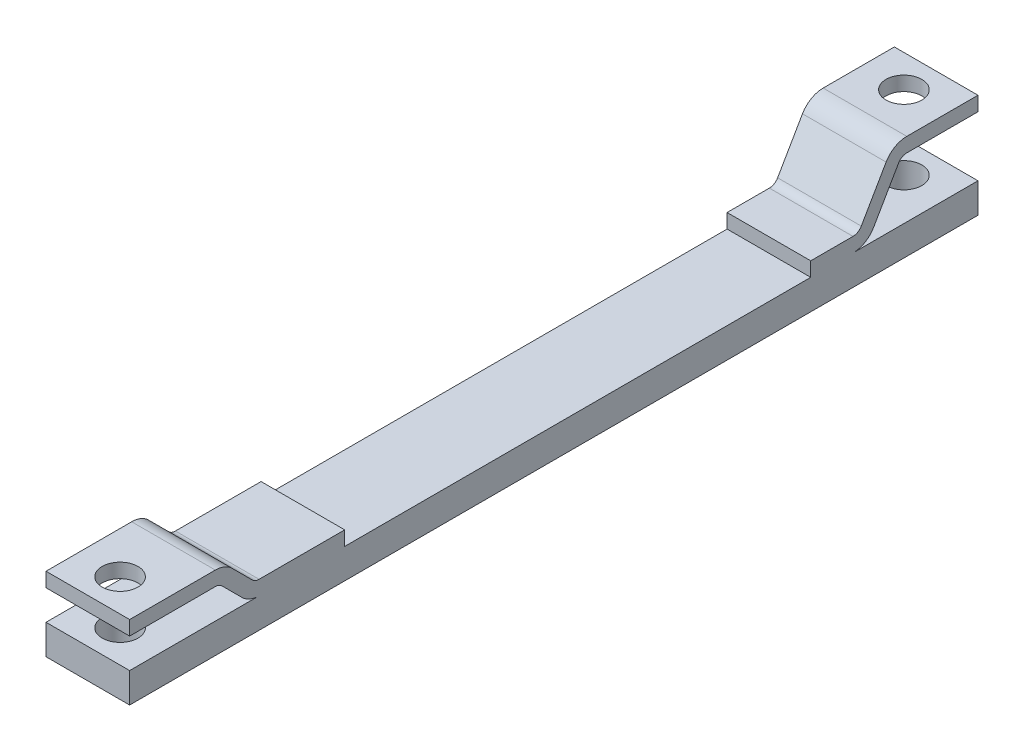
ISO-10303-21;
HEADER;
FILE_DESCRIPTION(('STEP AP214'),'2;1');
FILE_NAME('part.step','',(''),(''),'','','');
FILE_SCHEMA(('AUTOMOTIVE_DESIGN { 1 0 10303 214 1 1 1 1 }'));
ENDSEC;
DATA;
#1=APPLICATION_CONTEXT('core data for automotive mechanical design processes');
#2=APPLICATION_PROTOCOL_DEFINITION('international standard','automotive_design',2000,#1);
#3=PRODUCT_CONTEXT('',#1,'mechanical');
#4=PRODUCT('Part','Part','',(#3));
#5=PRODUCT_RELATED_PRODUCT_CATEGORY('part','',(#4));
#6=PRODUCT_DEFINITION_FORMATION('','',#4);
#7=PRODUCT_DEFINITION_CONTEXT('part definition',#1,'design');
#8=PRODUCT_DEFINITION('design','',#6,#7);
#9=PRODUCT_DEFINITION_SHAPE('','',#8);
#10=(LENGTH_UNIT() NAMED_UNIT(*) SI_UNIT(.MILLI.,.METRE.));
#11=(NAMED_UNIT(*) PLANE_ANGLE_UNIT() SI_UNIT($,.RADIAN.));
#12=(NAMED_UNIT(*) SI_UNIT($,.STERADIAN.) SOLID_ANGLE_UNIT());
#13=UNCERTAINTY_MEASURE_WITH_UNIT(LENGTH_MEASURE(1.E-05),#10,'distance_accuracy_value','');
#14=(GEOMETRIC_REPRESENTATION_CONTEXT(3) GLOBAL_UNCERTAINTY_ASSIGNED_CONTEXT((#13)) GLOBAL_UNIT_ASSIGNED_CONTEXT((#10,
#11,#12)) REPRESENTATION_CONTEXT('',''));
#15=CARTESIAN_POINT('',(0.,0.,0.));
#16=DIRECTION('',(0.,0.,1.));
#17=DIRECTION('',(1.,0.,0.));
#18=AXIS2_PLACEMENT_3D('',#15,#16,#17);
#19=CARTESIAN_POINT('',(70.,0.,-911.522356507685));
#20=DIRECTION('',(0.,1.,0.));
#21=DIRECTION('',(0.,0.,1.));
#22=AXIS2_PLACEMENT_3D('',#19,#20,#21);
#23=PLANE('',#22);
#24=CARTESIAN_POINT('',(35.,0.,-683.));
#25=DIRECTION('',(0.,1.,0.));
#26=DIRECTION('',(0.,0.,1.));
#27=AXIS2_PLACEMENT_3D('',#24,#25,#26);
#28=CIRCLE('',#27,15.);
#29=CARTESIAN_POINT('',(35.,0.,-668.));
#30=VERTEX_POINT('',#29);
#31=EDGE_CURVE('E474',#30,#30,#28,.T.);
#32=ORIENTED_EDGE('',*,*,#31,.T.);
#33=EDGE_LOOP('',(#32));
#34=FACE_BOUND('',#33,.T.);
#35=DIRECTION('',(0.,0.,-1.));
#36=VECTOR('',#35,1.);
#37=CARTESIAN_POINT('',(0.,0.,-911.522356507685));
#38=LINE('',#37,#36);
#39=CARTESIAN_POINT('',(0.,0.,0.));
#40=VERTEX_POINT('',#39);
#41=CARTESIAN_POINT('',(0.,0.,-710.));
#42=VERTEX_POINT('',#41);
#43=EDGE_CURVE('E260',#40,#42,#38,.T.);
#44=ORIENTED_EDGE('',*,*,#43,.T.);
#45=DIRECTION('',(-1.,0.,0.));
#46=VECTOR('',#45,1.);
#47=CARTESIAN_POINT('',(70.,0.,-710.));
#48=LINE('',#47,#46);
#49=CARTESIAN_POINT('',(70.,0.,-710.));
#50=VERTEX_POINT('',#49);
#51=EDGE_CURVE('E372',#50,#42,#48,.T.);
#52=ORIENTED_EDGE('',*,*,#51,.F.);
#53=DIRECTION('',(0.,0.,-1.));
#54=VECTOR('',#53,1.);
#55=CARTESIAN_POINT('',(70.,0.,-911.522356507685));
#56=LINE('',#55,#54);
#57=CARTESIAN_POINT('',(70.,0.,0.));
#58=VERTEX_POINT('',#57);
#59=EDGE_CURVE('E404',#58,#50,#56,.T.);
#60=ORIENTED_EDGE('',*,*,#59,.F.);
#61=DIRECTION('',(-1.,0.,0.));
#62=VECTOR('',#61,1.);
#63=CARTESIAN_POINT('',(70.,0.,0.));
#64=LINE('',#63,#62);
#65=EDGE_CURVE('E375',#58,#40,#64,.T.);
#66=ORIENTED_EDGE('',*,*,#65,.T.);
#67=EDGE_LOOP('',(#44,#52,#60,#66));
#68=FACE_BOUND('',#67,.T.);
#69=CARTESIAN_POINT('',(35.,0.,-27.0000000000002));
#70=DIRECTION('',(0.,1.,0.));
#71=DIRECTION('',(0.,0.,1.));
#72=AXIS2_PLACEMENT_3D('',#69,#70,#71);
#73=CIRCLE('',#72,15.);
#74=CARTESIAN_POINT('',(35.,0.,-12.0000000000002));
#75=VERTEX_POINT('',#74);
#76=EDGE_CURVE('E844',#75,#75,#73,.T.);
#77=ORIENTED_EDGE('',*,*,#76,.T.);
#78=EDGE_LOOP('',(#77));
#79=FACE_BOUND('',#78,.T.);
#80=ADVANCED_FACE('F36',(#34,#68,#79),#23,.F.);
#81=CARTESIAN_POINT('',(70.,25.0000000000005,-911.522356507685));
#82=DIRECTION('',(0.,-1.,0.));
#83=DIRECTION('',(0.,0.,-1.));
#84=AXIS2_PLACEMENT_3D('',#81,#82,#83);
#85=PLANE('',#84);
#86=DIRECTION('',(0.,0.,1.));
#87=VECTOR('',#86,1.);
#88=CARTESIAN_POINT('',(0.,25.0000000000005,-911.522356507685));
#89=LINE('',#88,#87);
#90=CARTESIAN_POINT('',(0.,25.0000000000001,-108.284271247462));
#91=VERTEX_POINT('',#90);
#92=CARTESIAN_POINT('',(0.,25.,0.));
#93=VERTEX_POINT('',#92);
#94=EDGE_CURVE('E255',#91,#93,#89,.T.);
#95=ORIENTED_EDGE('',*,*,#94,.T.);
#96=DIRECTION('',(-1.,0.,0.));
#97=VECTOR('',#96,1.);
#98=CARTESIAN_POINT('',(70.,25.,0.));
#99=LINE('',#98,#97);
#100=CARTESIAN_POINT('',(70.,25.,0.));
#101=VERTEX_POINT('',#100);
#102=EDGE_CURVE('E46',#101,#93,#99,.T.);
#103=ORIENTED_EDGE('',*,*,#102,.F.);
#104=DIRECTION('',(0.,0.,1.));
#105=VECTOR('',#104,1.);
#106=CARTESIAN_POINT('',(70.,25.0000000000005,-911.522356507685));
#107=LINE('',#106,#105);
#108=CARTESIAN_POINT('',(70.,25.0000000000001,-108.284271247462));
#109=VERTEX_POINT('',#108);
#110=EDGE_CURVE('E462',#109,#101,#107,.T.);
#111=ORIENTED_EDGE('',*,*,#110,.F.);
#112=DIRECTION('',(-1.,0.,0.));
#113=VECTOR('',#112,1.);
#114=CARTESIAN_POINT('',(70.,25.0000000000001,-108.284271247462));
#115=LINE('',#114,#113);
#116=EDGE_CURVE('E11',#109,#91,#115,.T.);
#117=ORIENTED_EDGE('',*,*,#116,.T.);
#118=EDGE_LOOP('',(#95,#103,#111,#117));
#119=FACE_BOUND('',#118,.T.);
#120=CARTESIAN_POINT('',(35.,25.,-27.0000000000002));
#121=DIRECTION('',(0.,-1.,0.));
#122=DIRECTION('',(0.,0.,-1.));
#123=AXIS2_PLACEMENT_3D('',#120,#121,#122);
#124=CIRCLE('',#123,15.);
#125=CARTESIAN_POINT('',(35.,25.,-42.0000000000002));
#126=VERTEX_POINT('',#125);
#127=EDGE_CURVE('E472',#126,#126,#124,.F.);
#128=ORIENTED_EDGE('',*,*,#127,.F.);
#129=EDGE_LOOP('',(#128));
#130=FACE_BOUND('',#129,.T.);
#131=ADVANCED_FACE('F467',(#119,#130),#85,.F.);
#132=CARTESIAN_POINT('',(70.,61.9999999999993,-911.522356507685));
#133=DIRECTION('',(0.,-1.,0.));
#134=DIRECTION('',(0.,0.,-1.));
#135=AXIS2_PLACEMENT_3D('',#132,#133,#134);
#136=PLANE('',#135);
#137=DIRECTION('',(0.,0.,1.));
#138=VECTOR('',#137,1.);
#139=CARTESIAN_POINT('',(0.,61.9999999999993,-911.522356507685));
#140=LINE('',#139,#138);
#141=CARTESIAN_POINT('',(0.,62.,-71.7157287525382));
#142=VERTEX_POINT('',#141);
#143=CARTESIAN_POINT('',(0.,62.0000000000001,0.));
#144=VERTEX_POINT('',#143);
#145=EDGE_CURVE('E308',#142,#144,#140,.T.);
#146=ORIENTED_EDGE('',*,*,#145,.T.);
#147=DIRECTION('',(-1.,0.,0.));
#148=VECTOR('',#147,1.);
#149=CARTESIAN_POINT('',(70.,62.0000000000001,0.));
#150=LINE('',#149,#148);
#151=CARTESIAN_POINT('',(70.,62.0000000000001,0.));
#152=VERTEX_POINT('',#151);
#153=EDGE_CURVE('E320',#152,#144,#150,.T.);
#154=ORIENTED_EDGE('',*,*,#153,.F.);
#155=DIRECTION('',(0.,0.,1.));
#156=VECTOR('',#155,1.);
#157=CARTESIAN_POINT('',(70.,61.9999999999993,-911.522356507685));
#158=LINE('',#157,#156);
#159=CARTESIAN_POINT('',(70.,62.,-71.7157287525382));
#160=VERTEX_POINT('',#159);
#161=EDGE_CURVE('E448',#160,#152,#158,.T.);
#162=ORIENTED_EDGE('',*,*,#161,.F.);
#163=DIRECTION('',(-1.,0.,0.));
#164=VECTOR('',#163,1.);
#165=CARTESIAN_POINT('',(70.,62.,-71.7157287525382));
#166=LINE('',#165,#164);
#167=EDGE_CURVE('E323',#160,#142,#166,.T.);
#168=ORIENTED_EDGE('',*,*,#167,.T.);
#169=EDGE_LOOP('',(#146,#154,#162,#168));
#170=FACE_BOUND('',#169,.T.);
#171=CARTESIAN_POINT('',(35.,62.,-27.0000000000002));
#172=DIRECTION('',(0.,-1.,0.));
#173=DIRECTION('',(0.,0.,-1.));
#174=AXIS2_PLACEMENT_3D('',#171,#172,#173);
#175=CIRCLE('',#174,15.);
#176=CARTESIAN_POINT('',(35.,62.,-42.0000000000002));
#177=VERTEX_POINT('',#176);
#178=EDGE_CURVE('E475',#177,#177,#175,.F.);
#179=ORIENTED_EDGE('',*,*,#178,.F.);
#180=EDGE_LOOP('',(#179));
#181=FACE_BOUND('',#180,.T.);
#182=ADVANCED_FACE('F453',(#170,#181),#136,.F.);
#183=CARTESIAN_POINT('',(70.,49.9999999999999,-911.522356507685));
#184=DIRECTION('',(0.,1.,0.));
#185=DIRECTION('',(0.,0.,1.));
#186=AXIS2_PLACEMENT_3D('',#183,#184,#185);
#187=PLANE('',#186);
#188=DIRECTION('',(0.,0.,-1.));
#189=VECTOR('',#188,1.);
#190=CARTESIAN_POINT('',(0.,49.9999999999999,-911.522356507685));
#191=LINE('',#190,#189);
#192=CARTESIAN_POINT('',(0.,49.9999999999999,0.));
#193=VERTEX_POINT('',#192);
#194=CARTESIAN_POINT('',(0.,49.9999999999999,-71.6862915010153));
#195=VERTEX_POINT('',#194);
#196=EDGE_CURVE('E243',#193,#195,#191,.T.);
#197=ORIENTED_EDGE('',*,*,#196,.T.);
#198=DIRECTION('',(-1.,0.,0.));
#199=VECTOR('',#198,1.);
#200=CARTESIAN_POINT('',(70.,49.9999999999999,-71.6862915010153));
#201=LINE('',#200,#199);
#202=CARTESIAN_POINT('',(70.,49.9999999999999,-71.6862915010153));
#203=VERTEX_POINT('',#202);
#204=EDGE_CURVE('E239',#203,#195,#201,.T.);
#205=ORIENTED_EDGE('',*,*,#204,.F.);
#206=DIRECTION('',(0.,0.,-1.));
#207=VECTOR('',#206,1.);
#208=CARTESIAN_POINT('',(70.,49.9999999999999,-911.522356507685));
#209=LINE('',#208,#207);
#210=CARTESIAN_POINT('',(70.,49.9999999999999,0.));
#211=VERTEX_POINT('',#210);
#212=EDGE_CURVE('E228',#211,#203,#209,.T.);
#213=ORIENTED_EDGE('',*,*,#212,.F.);
#214=DIRECTION('',(-1.,0.,0.));
#215=VECTOR('',#214,1.);
#216=CARTESIAN_POINT('',(70.,49.9999999999999,0.));
#217=LINE('',#216,#215);
#218=EDGE_CURVE('E244',#211,#193,#217,.T.);
#219=ORIENTED_EDGE('',*,*,#218,.T.);
#220=EDGE_LOOP('',(#197,#205,#213,#219));
#221=FACE_BOUND('',#220,.T.);
#222=CARTESIAN_POINT('',(35.,49.9999999999999,-27.0000000000002));
#223=DIRECTION('',(0.,1.,0.));
#224=DIRECTION('',(0.,0.,1.));
#225=AXIS2_PLACEMENT_3D('',#222,#223,#224);
#226=CIRCLE('',#225,15.);
#227=CARTESIAN_POINT('',(35.,49.9999999999999,-12.0000000000002));
#228=VERTEX_POINT('',#227);
#229=EDGE_CURVE('E40',#228,#228,#226,.F.);
#230=ORIENTED_EDGE('',*,*,#229,.F.);
#231=EDGE_LOOP('',(#230));
#232=FACE_BOUND('',#231,.T.);
#233=ADVANCED_FACE('F240',(#221,#232),#187,.F.);
#234=CARTESIAN_POINT('',(70.,25.0000000000005,-911.522356507685));
#235=DIRECTION('',(0.,-1.,0.));
#236=DIRECTION('',(0.,0.,-1.));
#237=AXIS2_PLACEMENT_3D('',#234,#235,#236);
#238=PLANE('',#237);
#239=DIRECTION('',(0.,0.,1.));
#240=VECTOR('',#239,1.);
#241=CARTESIAN_POINT('',(0.,25.0000000000005,-911.522356507685));
#242=LINE('',#241,#240);
#243=CARTESIAN_POINT('',(0.,25.0000000000002,-710.));
#244=VERTEX_POINT('',#243);
#245=CARTESIAN_POINT('',(0.,25.,-605.381197846483));
#246=VERTEX_POINT('',#245);
#247=EDGE_CURVE('E264',#244,#246,#242,.T.);
#248=ORIENTED_EDGE('',*,*,#247,.T.);
#249=DIRECTION('',(-1.,0.,0.));
#250=VECTOR('',#249,1.);
#251=CARTESIAN_POINT('',(70.,25.,-605.381197846483));
#252=LINE('',#251,#250);
#253=CARTESIAN_POINT('',(70.,25.,-605.381197846483));
#254=VERTEX_POINT('',#253);
#255=EDGE_CURVE('E367',#254,#246,#252,.T.);
#256=ORIENTED_EDGE('',*,*,#255,.F.);
#257=DIRECTION('',(0.,0.,1.));
#258=VECTOR('',#257,1.);
#259=CARTESIAN_POINT('',(70.,25.0000000000005,-911.522356507685));
#260=LINE('',#259,#258);
#261=CARTESIAN_POINT('',(70.,25.0000000000002,-710.));
#262=VERTEX_POINT('',#261);
#263=EDGE_CURVE('E403',#262,#254,#260,.T.);
#264=ORIENTED_EDGE('',*,*,#263,.F.);
#265=DIRECTION('',(-1.,0.,0.));
#266=VECTOR('',#265,1.);
#267=CARTESIAN_POINT('',(70.,25.0000000000002,-710.));
#268=LINE('',#267,#266);
#269=EDGE_CURVE('E369',#262,#244,#268,.T.);
#270=ORIENTED_EDGE('',*,*,#269,.T.);
#271=EDGE_LOOP('',(#248,#256,#264,#270));
#272=FACE_BOUND('',#271,.T.);
#273=CARTESIAN_POINT('',(35.,25.0000000000001,-683.));
#274=DIRECTION('',(0.,-1.,0.));
#275=DIRECTION('',(0.,0.,-1.));
#276=AXIS2_PLACEMENT_3D('',#273,#274,#275);
#277=CIRCLE('',#276,15.);
#278=CARTESIAN_POINT('',(35.,25.0000000000002,-698.));
#279=VERTEX_POINT('',#278);
#280=EDGE_CURVE('E256',#279,#279,#277,.F.);
#281=ORIENTED_EDGE('',*,*,#280,.F.);
#282=EDGE_LOOP('',(#281));
#283=FACE_BOUND('',#282,.T.);
#284=ADVANCED_FACE('F494',(#272,#283),#238,.F.);
#285=CARTESIAN_POINT('',(70.,75.0000000000007,-911.522356507685));
#286=DIRECTION('',(0.,1.,0.));
#287=DIRECTION('',(0.,0.,1.));
#288=AXIS2_PLACEMENT_3D('',#285,#286,#287);
#289=PLANE('',#288);
#290=DIRECTION('',(0.,0.,-1.));
#291=VECTOR('',#290,1.);
#292=CARTESIAN_POINT('',(0.,75.0000000000007,-911.522356507685));
#293=LINE('',#292,#291);
#294=CARTESIAN_POINT('',(0.,75.,-650.414518843274));
#295=VERTEX_POINT('',#294);
#296=CARTESIAN_POINT('',(0.,75.0000000000002,-710.));
#297=VERTEX_POINT('',#296);
#298=EDGE_CURVE('E276',#295,#297,#293,.T.);
#299=ORIENTED_EDGE('',*,*,#298,.T.);
#300=DIRECTION('',(-1.,0.,0.));
#301=VECTOR('',#300,1.);
#302=CARTESIAN_POINT('',(70.,75.0000000000002,-710.));
#303=LINE('',#302,#301);
#304=CARTESIAN_POINT('',(70.,75.0000000000002,-710.));
#305=VERTEX_POINT('',#304);
#306=EDGE_CURVE('E358',#305,#297,#303,.T.);
#307=ORIENTED_EDGE('',*,*,#306,.F.);
#308=DIRECTION('',(0.,0.,-1.));
#309=VECTOR('',#308,1.);
#310=CARTESIAN_POINT('',(70.,75.0000000000007,-911.522356507685));
#311=LINE('',#310,#309);
#312=CARTESIAN_POINT('',(70.,75.,-650.414518843274));
#313=VERTEX_POINT('',#312);
#314=EDGE_CURVE('E418',#313,#305,#311,.T.);
#315=ORIENTED_EDGE('',*,*,#314,.F.);
#316=DIRECTION('',(-1.,0.,0.));
#317=VECTOR('',#316,1.);
#318=CARTESIAN_POINT('',(70.,75.,-650.414518843274));
#319=LINE('',#318,#317);
#320=EDGE_CURVE('E361',#313,#295,#319,.T.);
#321=ORIENTED_EDGE('',*,*,#320,.T.);
#322=EDGE_LOOP('',(#299,#307,#315,#321));
#323=FACE_BOUND('',#322,.T.);
#324=CARTESIAN_POINT('',(35.,75.0000000000001,-683.));
#325=DIRECTION('',(0.,1.,0.));
#326=DIRECTION('',(0.,0.,1.));
#327=AXIS2_PLACEMENT_3D('',#324,#325,#326);
#328=CIRCLE('',#327,15.);
#329=CARTESIAN_POINT('',(35.,75.0000000000001,-668.));
#330=VERTEX_POINT('',#329);
#331=EDGE_CURVE('E485',#330,#330,#328,.F.);
#332=ORIENTED_EDGE('',*,*,#331,.F.);
#333=EDGE_LOOP('',(#332));
#334=FACE_BOUND('',#333,.T.);
#335=ADVANCED_FACE('F496',(#323,#334),#289,.F.);
#336=CARTESIAN_POINT('',(70.,87.0000000000007,-911.522356507685));
#337=DIRECTION('',(0.,-1.,0.));
#338=DIRECTION('',(0.,0.,-1.));
#339=AXIS2_PLACEMENT_3D('',#336,#337,#338);
#340=PLANE('',#339);
#341=DIRECTION('',(0.,0.,1.));
#342=VECTOR('',#341,1.);
#343=CARTESIAN_POINT('',(0.,87.0000000000007,-911.522356507685));
#344=LINE('',#343,#342);
#345=CARTESIAN_POINT('',(0.,87.0000000000001,-710.));
#346=VERTEX_POINT('',#345);
#347=CARTESIAN_POINT('',(0.,87.,-650.414518843274));
#348=VERTEX_POINT('',#347);
#349=EDGE_CURVE('E280',#346,#348,#344,.T.);
#350=ORIENTED_EDGE('',*,*,#349,.T.);
#351=DIRECTION('',(-1.,0.,0.));
#352=VECTOR('',#351,1.);
#353=CARTESIAN_POINT('',(70.,87.,-650.414518843274));
#354=LINE('',#353,#352);
#355=CARTESIAN_POINT('',(70.,87.,-650.414518843274));
#356=VERTEX_POINT('',#355);
#357=EDGE_CURVE('E352',#356,#348,#354,.T.);
#358=ORIENTED_EDGE('',*,*,#357,.F.);
#359=DIRECTION('',(0.,0.,1.));
#360=VECTOR('',#359,1.);
#361=CARTESIAN_POINT('',(70.,87.0000000000007,-911.522356507685));
#362=LINE('',#361,#360);
#363=CARTESIAN_POINT('',(70.,87.0000000000001,-710.));
#364=VERTEX_POINT('',#363);
#365=EDGE_CURVE('E422',#364,#356,#362,.T.);
#366=ORIENTED_EDGE('',*,*,#365,.F.);
#367=DIRECTION('',(-1.,0.,0.));
#368=VECTOR('',#367,1.);
#369=CARTESIAN_POINT('',(70.,87.0000000000001,-710.));
#370=LINE('',#369,#368);
#371=EDGE_CURVE('E355',#364,#346,#370,.T.);
#372=ORIENTED_EDGE('',*,*,#371,.T.);
#373=EDGE_LOOP('',(#350,#358,#366,#372));
#374=FACE_BOUND('',#373,.T.);
#375=CARTESIAN_POINT('',(35.,87.0000000000001,-683.));
#376=DIRECTION('',(0.,1.,0.));
#377=DIRECTION('',(0.,0.,1.));
#378=AXIS2_PLACEMENT_3D('',#375,#376,#377);
#379=CIRCLE('',#378,15.);
#380=CARTESIAN_POINT('',(35.,87.0000000000001,-668.));
#381=VERTEX_POINT('',#380);
#382=EDGE_CURVE('E478',#381,#381,#379,.T.);
#383=ORIENTED_EDGE('',*,*,#382,.F.);
#384=EDGE_LOOP('',(#383));
#385=FACE_BOUND('',#384,.T.);
#386=ADVANCED_FACE('F503',(#374,#385),#340,.F.);
#387=CARTESIAN_POINT('',(70.,45.0000000000001,-108.284271247462));
#388=DIRECTION('',(-1.,0.,0.));
#389=DIRECTION('',(0.,0.,1.));
#390=AXIS2_PLACEMENT_3D('',#387,#388,#389);
#391=CYLINDRICAL_SURFACE('',#390,20.);
#392=CARTESIAN_POINT('',(0.,45.0000000000001,-108.284271247462));
#393=DIRECTION('',(1.,0.,0.));
#394=DIRECTION('',(0.,0.,-1.));
#395=AXIS2_PLACEMENT_3D('',#392,#393,#394);
#396=CIRCLE('',#395,20.);
#397=CARTESIAN_POINT('',(0.,30.8578643762691,-94.1421356237309));
#398=VERTEX_POINT('',#397);
#399=EDGE_CURVE('E252',#91,#398,#396,.F.);
#400=ORIENTED_EDGE('',*,*,#399,.F.);
#401=ORIENTED_EDGE('',*,*,#116,.F.);
#402=CARTESIAN_POINT('',(70.,45.0000000000001,-108.284271247462));
#403=DIRECTION('',(1.,0.,0.));
#404=DIRECTION('',(0.,0.,-1.));
#405=AXIS2_PLACEMENT_3D('',#402,#403,#404);
#406=CIRCLE('',#405,20.);
#407=CARTESIAN_POINT('',(70.,30.8578643762691,-94.1421356237309));
#408=VERTEX_POINT('',#407);
#409=EDGE_CURVE('E316',#109,#408,#406,.F.);
#410=ORIENTED_EDGE('',*,*,#409,.T.);
#411=DIRECTION('',(-1.,0.,0.));
#412=VECTOR('',#411,1.);
#413=CARTESIAN_POINT('',(70.,30.8578643762691,-94.1421356237309));
#414=LINE('',#413,#412);
#415=EDGE_CURVE('E149',#408,#398,#414,.T.);
#416=ORIENTED_EDGE('',*,*,#415,.T.);
#417=EDGE_LOOP('',(#400,#401,#410,#416));
#418=FACE_BOUND('',#417,.T.);
#419=ADVANCED_FACE('F38',(#418),#391,.T.);
#420=CARTESIAN_POINT('',(70.,43.5000000000005,0.));
#421=DIRECTION('',(0.,0.,-1.));
#422=DIRECTION('',(0.,1.,0.));
#423=AXIS2_PLACEMENT_3D('',#420,#421,#422);
#424=PLANE('',#423);
#425=DIRECTION('',(0.,-1.,0.));
#426=VECTOR('',#425,1.);
#427=CARTESIAN_POINT('',(0.,43.5000000000005,0.));
#428=LINE('',#427,#426);
#429=EDGE_CURVE('E258',#93,#40,#428,.T.);
#430=ORIENTED_EDGE('',*,*,#429,.T.);
#431=ORIENTED_EDGE('',*,*,#65,.F.);
#432=DIRECTION('',(0.,-1.,0.));
#433=VECTOR('',#432,1.);
#434=CARTESIAN_POINT('',(70.,43.5000000000005,0.));
#435=LINE('',#434,#433);
#436=EDGE_CURVE('E385',#101,#58,#435,.T.);
#437=ORIENTED_EDGE('',*,*,#436,.F.);
#438=ORIENTED_EDGE('',*,*,#102,.T.);
#439=EDGE_LOOP('',(#430,#431,#437,#438));
#440=FACE_BOUND('',#439,.T.);
#441=ADVANCED_FACE('F383',(#440),#424,.F.);
#442=CARTESIAN_POINT('',(70.,43.5,-710.));
#443=DIRECTION('',(0.,0.,1.));
#444=DIRECTION('',(1.,0.,0.));
#445=AXIS2_PLACEMENT_3D('',#442,#443,#444);
#446=PLANE('',#445);
#447=DIRECTION('',(0.,1.,0.));
#448=VECTOR('',#447,1.);
#449=CARTESIAN_POINT('',(0.,43.5,-710.));
#450=LINE('',#449,#448);
#451=EDGE_CURVE('E262',#42,#244,#450,.T.);
#452=ORIENTED_EDGE('',*,*,#451,.T.);
#453=ORIENTED_EDGE('',*,*,#269,.F.);
#454=DIRECTION('',(0.,1.,0.));
#455=VECTOR('',#454,1.);
#456=CARTESIAN_POINT('',(70.,43.5,-710.));
#457=LINE('',#456,#455);
#458=EDGE_CURVE('E401',#50,#262,#457,.T.);
#459=ORIENTED_EDGE('',*,*,#458,.F.);
#460=ORIENTED_EDGE('',*,*,#51,.T.);
#461=EDGE_LOOP('',(#452,#453,#459,#460));
#462=FACE_BOUND('',#461,.T.);
#463=ADVANCED_FACE('F399',(#462),#446,.F.);
#464=CARTESIAN_POINT('',(70.,45.0000000000001,-605.381197846483));
#465=DIRECTION('',(-1.,0.,0.));
#466=DIRECTION('',(0.,0.,1.));
#467=AXIS2_PLACEMENT_3D('',#464,#465,#466);
#468=CYLINDRICAL_SURFACE('',#467,20.0000000000002);
#469=CARTESIAN_POINT('',(0.,45.0000000000001,-605.381197846483));
#470=DIRECTION('',(1.,0.,0.));
#471=DIRECTION('',(0.,0.,-1.));
#472=AXIS2_PLACEMENT_3D('',#469,#470,#471);
#473=CIRCLE('',#472,20.0000000000002);
#474=CARTESIAN_POINT('',(0.,34.9999999999999,-622.701705922172));
#475=VERTEX_POINT('',#474);
#476=EDGE_CURVE('E267',#475,#246,#473,.F.);
#477=ORIENTED_EDGE('',*,*,#476,.F.);
#478=DIRECTION('',(-1.,0.,0.));
#479=VECTOR('',#478,1.);
#480=CARTESIAN_POINT('',(70.,34.9999999999999,-622.701705922172));
#481=LINE('',#480,#479);
#482=CARTESIAN_POINT('',(70.,34.9999999999999,-622.701705922172));
#483=VERTEX_POINT('',#482);
#484=EDGE_CURVE('E365',#483,#475,#481,.T.);
#485=ORIENTED_EDGE('',*,*,#484,.F.);
#486=CARTESIAN_POINT('',(70.,45.0000000000001,-605.381197846483));
#487=DIRECTION('',(1.,0.,0.));
#488=DIRECTION('',(0.,0.,-1.));
#489=AXIS2_PLACEMENT_3D('',#486,#487,#488);
#490=CIRCLE('',#489,20.0000000000002);
#491=EDGE_CURVE('E406',#483,#254,#490,.F.);
#492=ORIENTED_EDGE('',*,*,#491,.T.);
#493=ORIENTED_EDGE('',*,*,#255,.T.);
#494=EDGE_LOOP('',(#477,#485,#492,#493));
#495=FACE_BOUND('',#494,.T.);
#496=ADVANCED_FACE('F520',(#495),#468,.T.);
#497=CARTESIAN_POINT('',(70.,166.438010272303,-698.587476534635));
#498=DIRECTION('',(0.,0.500000000000004,0.866025403784436));
#499=DIRECTION('',(0.,-0.866025403784436,0.500000000000004));
#500=AXIS2_PLACEMENT_3D('',#497,#498,#499);
#501=PLANE('',#500);
#502=DIRECTION('',(0.,0.866025403784436,-0.500000000000004));
#503=VECTOR('',#502,1.);
#504=CARTESIAN_POINT('',(0.,166.438010272303,-698.587476534635));
#505=LINE('',#504,#503);
#506=CARTESIAN_POINT('',(0.,71.0000000000001,-643.486315612998));
#507=VERTEX_POINT('',#506);
#508=EDGE_CURVE('E270',#475,#507,#505,.T.);
#509=ORIENTED_EDGE('',*,*,#508,.T.);
#510=DIRECTION('',(-1.,0.,0.));
#511=VECTOR('',#510,1.);
#512=CARTESIAN_POINT('',(70.,71.0000000000001,-643.486315612998));
#513=LINE('',#512,#511);
#514=CARTESIAN_POINT('',(70.,71.0000000000001,-643.486315612998));
#515=VERTEX_POINT('',#514);
#516=EDGE_CURVE('E363',#515,#507,#513,.T.);
#517=ORIENTED_EDGE('',*,*,#516,.F.);
#518=DIRECTION('',(0.,0.866025403784436,-0.500000000000004));
#519=VECTOR('',#518,1.);
#520=CARTESIAN_POINT('',(70.,166.438010272303,-698.587476534635));
#521=LINE('',#520,#519);
#522=EDGE_CURVE('E413',#483,#515,#521,.T.);
#523=ORIENTED_EDGE('',*,*,#522,.F.);
#524=ORIENTED_EDGE('',*,*,#484,.T.);
#525=EDGE_LOOP('',(#509,#517,#523,#524));
#526=FACE_BOUND('',#525,.T.);
#527=ADVANCED_FACE('F540',(#526),#501,.F.);
#528=CARTESIAN_POINT('',(70.,67.0000000000002,-650.414518843274));
#529=DIRECTION('',(-1.,0.,0.));
#530=DIRECTION('',(0.,0.,1.));
#531=AXIS2_PLACEMENT_3D('',#528,#529,#530);
#532=CYLINDRICAL_SURFACE('',#531,7.99999999999986);
#533=CARTESIAN_POINT('',(0.,67.0000000000002,-650.414518843274));
#534=DIRECTION('',(1.,0.,0.));
#535=DIRECTION('',(0.,0.,-1.));
#536=AXIS2_PLACEMENT_3D('',#533,#534,#535);
#537=CIRCLE('',#536,7.99999999999986);
#538=EDGE_CURVE('E273',#295,#507,#537,.T.);
#539=ORIENTED_EDGE('',*,*,#538,.F.);
#540=ORIENTED_EDGE('',*,*,#320,.F.);
#541=CARTESIAN_POINT('',(70.,67.0000000000002,-650.414518843274));
#542=DIRECTION('',(1.,0.,0.));
#543=DIRECTION('',(0.,0.,-1.));
#544=AXIS2_PLACEMENT_3D('',#541,#542,#543);
#545=CIRCLE('',#544,7.99999999999986);
#546=EDGE_CURVE('E415',#313,#515,#545,.T.);
#547=ORIENTED_EDGE('',*,*,#546,.T.);
#548=ORIENTED_EDGE('',*,*,#516,.T.);
#549=EDGE_LOOP('',(#539,#540,#547,#548));
#550=FACE_BOUND('',#549,.T.);
#551=ADVANCED_FACE('F535',(#550),#532,.F.);
#552=CARTESIAN_POINT('',(70.,43.5,-710.));
#553=DIRECTION('',(0.,0.,1.));
#554=DIRECTION('',(1.,0.,0.));
#555=AXIS2_PLACEMENT_3D('',#552,#553,#554);
#556=PLANE('',#555);
#557=DIRECTION('',(0.,1.,0.));
#558=VECTOR('',#557,1.);
#559=CARTESIAN_POINT('',(0.,43.5,-710.));
#560=LINE('',#559,#558);
#561=EDGE_CURVE('E278',#297,#346,#560,.T.);
#562=ORIENTED_EDGE('',*,*,#561,.T.);
#563=ORIENTED_EDGE('',*,*,#371,.F.);
#564=DIRECTION('',(0.,1.,0.));
#565=VECTOR('',#564,1.);
#566=CARTESIAN_POINT('',(70.,43.5,-710.));
#567=LINE('',#566,#565);
#568=EDGE_CURVE('E420',#305,#364,#567,.T.);
#569=ORIENTED_EDGE('',*,*,#568,.F.);
#570=ORIENTED_EDGE('',*,*,#306,.T.);
#571=EDGE_LOOP('',(#562,#563,#569,#570));
#572=FACE_BOUND('',#571,.T.);
#573=ADVANCED_FACE('F533',(#572),#556,.F.);
#574=CARTESIAN_POINT('',(70.,67.0000000000002,-650.414518843274));
#575=DIRECTION('',(-1.,0.,0.));
#576=DIRECTION('',(0.,0.,1.));
#577=AXIS2_PLACEMENT_3D('',#574,#575,#576);
#578=CYLINDRICAL_SURFACE('',#577,19.9999999999998);
#579=CARTESIAN_POINT('',(0.,67.0000000000002,-650.414518843274));
#580=DIRECTION('',(1.,0.,0.));
#581=DIRECTION('',(0.,0.,-1.));
#582=AXIS2_PLACEMENT_3D('',#579,#580,#581);
#583=CIRCLE('',#582,19.9999999999998);
#584=CARTESIAN_POINT('',(0.,77.0000000000001,-633.094010767585));
#585=VERTEX_POINT('',#584);
#586=EDGE_CURVE('E282',#348,#585,#583,.T.);
#587=ORIENTED_EDGE('',*,*,#586,.T.);
#588=DIRECTION('',(-1.,0.,0.));
#589=VECTOR('',#588,1.);
#590=CARTESIAN_POINT('',(70.,77.0000000000001,-633.094010767585));
#591=LINE('',#590,#589);
#592=CARTESIAN_POINT('',(70.,77.0000000000001,-633.094010767585));
#593=VERTEX_POINT('',#592);
#594=EDGE_CURVE('E349',#593,#585,#591,.T.);
#595=ORIENTED_EDGE('',*,*,#594,.F.);
#596=CARTESIAN_POINT('',(70.,67.0000000000002,-650.414518843274));
#597=DIRECTION('',(1.,0.,0.));
#598=DIRECTION('',(0.,0.,-1.));
#599=AXIS2_PLACEMENT_3D('',#596,#597,#598);
#600=CIRCLE('',#599,19.9999999999998);
#601=EDGE_CURVE('E424',#356,#593,#600,.T.);
#602=ORIENTED_EDGE('',*,*,#601,.F.);
#603=ORIENTED_EDGE('',*,*,#357,.T.);
#604=EDGE_LOOP('',(#587,#595,#602,#603));
#605=FACE_BOUND('',#604,.T.);
#606=ADVANCED_FACE('F531',(#605),#578,.T.);
#607=CARTESIAN_POINT('',(70.,172.438010272303,-688.195171689222));
#608=DIRECTION('',(0.,-0.500000000000004,-0.866025403784436));
#609=DIRECTION('',(0.,0.866025403784436,-0.500000000000004));
#610=AXIS2_PLACEMENT_3D('',#607,#608,#609);
#611=PLANE('',#610);
#612=DIRECTION('',(0.,-0.866025403784436,0.500000000000004));
#613=VECTOR('',#612,1.);
#614=CARTESIAN_POINT('',(0.,172.438010272303,-688.195171689222));
#615=LINE('',#614,#613);
#616=CARTESIAN_POINT('',(0.,40.9999999999999,-612.309401076758));
#617=VERTEX_POINT('',#616);
#618=EDGE_CURVE('E284',#585,#617,#615,.T.);
#619=ORIENTED_EDGE('',*,*,#618,.T.);
#620=DIRECTION('',(-1.,0.,0.));
#621=VECTOR('',#620,1.);
#622=CARTESIAN_POINT('',(70.,40.9999999999999,-612.309401076758));
#623=LINE('',#622,#621);
#624=CARTESIAN_POINT('',(70.,40.9999999999999,-612.309401076758));
#625=VERTEX_POINT('',#624);
#626=EDGE_CURVE('E347',#625,#617,#623,.T.);
#627=ORIENTED_EDGE('',*,*,#626,.F.);
#628=DIRECTION('',(0.,-0.866025403784436,0.500000000000004));
#629=VECTOR('',#628,1.);
#630=CARTESIAN_POINT('',(70.,172.438010272303,-688.195171689222));
#631=LINE('',#630,#629);
#632=EDGE_CURVE('E426',#593,#625,#631,.T.);
#633=ORIENTED_EDGE('',*,*,#632,.F.);
#634=ORIENTED_EDGE('',*,*,#594,.T.);
#635=EDGE_LOOP('',(#619,#627,#633,#634));
#636=FACE_BOUND('',#635,.T.);
#637=ADVANCED_FACE('F574',(#636),#611,.F.);
#638=CARTESIAN_POINT('',(70.,44.9999999999999,-605.381197846483));
#639=DIRECTION('',(-1.,0.,0.));
#640=DIRECTION('',(0.,0.,1.));
#641=AXIS2_PLACEMENT_3D('',#638,#639,#640);
#642=CYLINDRICAL_SURFACE('',#641,8.00000000000013);
#643=CARTESIAN_POINT('',(0.,44.9999999999999,-605.381197846483));
#644=DIRECTION('',(1.,0.,0.));
#645=DIRECTION('',(0.,0.,-1.));
#646=AXIS2_PLACEMENT_3D('',#643,#644,#645);
#647=CIRCLE('',#646,8.00000000000013);
#648=CARTESIAN_POINT('',(0.,36.9999999999999,-605.381197846483));
#649=VERTEX_POINT('',#648);
#650=EDGE_CURVE('E287',#649,#617,#647,.T.);
#651=ORIENTED_EDGE('',*,*,#650,.F.);
#652=DIRECTION('',(-1.,0.,0.));
#653=VECTOR('',#652,1.);
#654=CARTESIAN_POINT('',(70.,36.9999999999999,-605.381197846483));
#655=LINE('',#654,#653);
#656=CARTESIAN_POINT('',(70.,36.9999999999999,-605.381197846483));
#657=VERTEX_POINT('',#656);
#658=EDGE_CURVE('E345',#657,#649,#655,.T.);
#659=ORIENTED_EDGE('',*,*,#658,.F.);
#660=CARTESIAN_POINT('',(70.,44.9999999999999,-605.381197846483));
#661=DIRECTION('',(1.,0.,0.));
#662=DIRECTION('',(0.,0.,-1.));
#663=AXIS2_PLACEMENT_3D('',#660,#661,#662);
#664=CIRCLE('',#663,8.00000000000013);
#665=EDGE_CURVE('E428',#657,#625,#664,.T.);
#666=ORIENTED_EDGE('',*,*,#665,.T.);
#667=ORIENTED_EDGE('',*,*,#626,.T.);
#668=EDGE_LOOP('',(#651,#659,#666,#667));
#669=FACE_BOUND('',#668,.T.);
#670=ADVANCED_FACE('F580',(#669),#642,.F.);
#671=CARTESIAN_POINT('',(70.,36.9999999999999,-911.522356507685));
#672=DIRECTION('',(0.,-1.,0.));
#673=DIRECTION('',(0.,0.,-1.));
#674=AXIS2_PLACEMENT_3D('',#671,#672,#673);
#675=PLANE('',#674);
#676=DIRECTION('',(0.,0.,1.));
#677=VECTOR('',#676,1.);
#678=CARTESIAN_POINT('',(0.,36.9999999999999,-911.522356507685));
#679=LINE('',#678,#677);
#680=CARTESIAN_POINT('',(0.,36.9999999999999,-570.));
#681=VERTEX_POINT('',#680);
#682=EDGE_CURVE('E290',#649,#681,#679,.T.);
#683=ORIENTED_EDGE('',*,*,#682,.T.);
#684=DIRECTION('',(-1.,0.,0.));
#685=VECTOR('',#684,1.);
#686=CARTESIAN_POINT('',(70.,36.9999999999999,-570.));
#687=LINE('',#686,#685);
#688=CARTESIAN_POINT('',(70.,36.9999999999999,-570.));
#689=VERTEX_POINT('',#688);
#690=EDGE_CURVE('E342',#689,#681,#687,.T.);
#691=ORIENTED_EDGE('',*,*,#690,.F.);
#692=DIRECTION('',(0.,0.,1.));
#693=VECTOR('',#692,1.);
#694=CARTESIAN_POINT('',(70.,36.9999999999999,-911.522356507685));
#695=LINE('',#694,#693);
#696=EDGE_CURVE('E431',#657,#689,#695,.T.);
#697=ORIENTED_EDGE('',*,*,#696,.F.);
#698=ORIENTED_EDGE('',*,*,#658,.T.);
#699=EDGE_LOOP('',(#683,#691,#697,#698));
#700=FACE_BOUND('',#699,.T.);
#701=ADVANCED_FACE('F583',(#700),#675,.F.);
#702=CARTESIAN_POINT('',(70.,43.5,-570.));
#703=DIRECTION('',(0.,0.,-1.));
#704=DIRECTION('',(-1.,0.,0.));
#705=AXIS2_PLACEMENT_3D('',#702,#703,#704);
#706=PLANE('',#705);
#707=DIRECTION('',(0.,-1.,0.));
#708=VECTOR('',#707,1.);
#709=CARTESIAN_POINT('',(0.,43.5,-570.));
#710=LINE('',#709,#708);
#711=CARTESIAN_POINT('',(0.,25.0000000000001,-570.));
#712=VERTEX_POINT('',#711);
#713=EDGE_CURVE('E292',#681,#712,#710,.T.);
#714=ORIENTED_EDGE('',*,*,#713,.T.);
#715=DIRECTION('',(-1.,0.,0.));
#716=VECTOR('',#715,1.);
#717=CARTESIAN_POINT('',(70.,25.0000000000001,-570.));
#718=LINE('',#717,#716);
#719=CARTESIAN_POINT('',(70.,25.0000000000001,-570.));
#720=VERTEX_POINT('',#719);
#721=EDGE_CURVE('E339',#720,#712,#718,.T.);
#722=ORIENTED_EDGE('',*,*,#721,.F.);
#723=DIRECTION('',(0.,-1.,0.));
#724=VECTOR('',#723,1.);
#725=CARTESIAN_POINT('',(70.,43.5,-570.));
#726=LINE('',#725,#724);
#727=EDGE_CURVE('E433',#689,#720,#726,.T.);
#728=ORIENTED_EDGE('',*,*,#727,.F.);
#729=ORIENTED_EDGE('',*,*,#690,.T.);
#730=EDGE_LOOP('',(#714,#722,#728,#729));
#731=FACE_BOUND('',#730,.T.);
#732=ADVANCED_FACE('F588',(#731),#706,.F.);
#733=CARTESIAN_POINT('',(70.,25.0000000000002,-911.522356507685));
#734=DIRECTION('',(0.,-1.,0.));
#735=DIRECTION('',(0.,0.,-1.));
#736=AXIS2_PLACEMENT_3D('',#733,#734,#735);
#737=PLANE('',#736);
#738=DIRECTION('',(0.,0.,1.));
#739=VECTOR('',#738,1.);
#740=CARTESIAN_POINT('',(0.,25.0000000000002,-911.522356507685));
#741=LINE('',#740,#739);
#742=CARTESIAN_POINT('',(0.,25.0000000000001,-180.));
#743=VERTEX_POINT('',#742);
#744=EDGE_CURVE('E294',#712,#743,#741,.T.);
#745=ORIENTED_EDGE('',*,*,#744,.T.);
#746=DIRECTION('',(-1.,0.,0.));
#747=VECTOR('',#746,1.);
#748=CARTESIAN_POINT('',(70.,25.0000000000001,-180.));
#749=LINE('',#748,#747);
#750=CARTESIAN_POINT('',(70.,25.0000000000001,-180.));
#751=VERTEX_POINT('',#750);
#752=EDGE_CURVE('E336',#751,#743,#749,.T.);
#753=ORIENTED_EDGE('',*,*,#752,.F.);
#754=DIRECTION('',(0.,0.,1.));
#755=VECTOR('',#754,1.);
#756=CARTESIAN_POINT('',(70.,25.0000000000002,-911.522356507685));
#757=LINE('',#756,#755);
#758=EDGE_CURVE('E435',#720,#751,#757,.T.);
#759=ORIENTED_EDGE('',*,*,#758,.F.);
#760=ORIENTED_EDGE('',*,*,#721,.T.);
#761=EDGE_LOOP('',(#745,#753,#759,#760));
#762=FACE_BOUND('',#761,.T.);
#763=ADVANCED_FACE('F594',(#762),#737,.F.);
#764=CARTESIAN_POINT('',(70.,43.5,-180.));
#765=DIRECTION('',(0.,0.,1.));
#766=DIRECTION('',(1.,0.,0.));
#767=AXIS2_PLACEMENT_3D('',#764,#765,#766);
#768=PLANE('',#767);
#769=DIRECTION('',(0.,1.,0.));
#770=VECTOR('',#769,1.);
#771=CARTESIAN_POINT('',(0.,43.5,-180.));
#772=LINE('',#771,#770);
#773=CARTESIAN_POINT('',(0.,37.,-180.));
#774=VERTEX_POINT('',#773);
#775=EDGE_CURVE('E296',#743,#774,#772,.T.);
#776=ORIENTED_EDGE('',*,*,#775,.T.);
#777=DIRECTION('',(-1.,0.,0.));
#778=VECTOR('',#777,1.);
#779=CARTESIAN_POINT('',(70.,37.,-180.));
#780=LINE('',#779,#778);
#781=CARTESIAN_POINT('',(70.,37.,-180.));
#782=VERTEX_POINT('',#781);
#783=EDGE_CURVE('E333',#782,#774,#780,.T.);
#784=ORIENTED_EDGE('',*,*,#783,.F.);
#785=DIRECTION('',(0.,1.,0.));
#786=VECTOR('',#785,1.);
#787=CARTESIAN_POINT('',(70.,43.5,-180.));
#788=LINE('',#787,#786);
#789=EDGE_CURVE('E437',#751,#782,#788,.T.);
#790=ORIENTED_EDGE('',*,*,#789,.F.);
#791=ORIENTED_EDGE('',*,*,#752,.T.);
#792=EDGE_LOOP('',(#776,#784,#790,#791));
#793=FACE_BOUND('',#792,.T.);
#794=ADVANCED_FACE('F598',(#793),#768,.F.);
#795=CARTESIAN_POINT('',(70.,37.,-911.522356507685));
#796=DIRECTION('',(0.,-1.,0.));
#797=DIRECTION('',(0.,0.,-1.));
#798=AXIS2_PLACEMENT_3D('',#795,#796,#797);
#799=PLANE('',#798);
#800=DIRECTION('',(0.,0.,1.));
#801=VECTOR('',#800,1.);
#802=CARTESIAN_POINT('',(0.,37.,-911.522356507685));
#803=LINE('',#802,#801);
#804=CARTESIAN_POINT('',(0.,37.,-108.313708498985));
#805=VERTEX_POINT('',#804);
#806=EDGE_CURVE('E298',#774,#805,#803,.T.);
#807=ORIENTED_EDGE('',*,*,#806,.T.);
#808=DIRECTION('',(-1.,0.,0.));
#809=VECTOR('',#808,1.);
#810=CARTESIAN_POINT('',(70.,37.,-108.313708498985));
#811=LINE('',#810,#809);
#812=CARTESIAN_POINT('',(70.,37.,-108.313708498985));
#813=VERTEX_POINT('',#812);
#814=EDGE_CURVE('E330',#813,#805,#811,.T.);
#815=ORIENTED_EDGE('',*,*,#814,.F.);
#816=DIRECTION('',(0.,0.,1.));
#817=VECTOR('',#816,1.);
#818=CARTESIAN_POINT('',(70.,37.,-911.522356507685));
#819=LINE('',#818,#817);
#820=EDGE_CURVE('E439',#782,#813,#819,.T.);
#821=ORIENTED_EDGE('',*,*,#820,.F.);
#822=ORIENTED_EDGE('',*,*,#783,.T.);
#823=EDGE_LOOP('',(#807,#815,#821,#822));
#824=FACE_BOUND('',#823,.T.);
#825=ADVANCED_FACE('F603',(#824),#799,.F.);
#826=CARTESIAN_POINT('',(70.,45.,-108.313708498985));
#827=DIRECTION('',(-1.,0.,0.));
#828=DIRECTION('',(0.,0.,1.));
#829=AXIS2_PLACEMENT_3D('',#826,#827,#828);
#830=CYLINDRICAL_SURFACE('',#829,8.);
#831=CARTESIAN_POINT('',(0.,45.,-108.313708498985));
#832=DIRECTION('',(1.,0.,0.));
#833=DIRECTION('',(0.,0.,-1.));
#834=AXIS2_PLACEMENT_3D('',#831,#832,#833);
#835=CIRCLE('',#834,8.);
#836=CARTESIAN_POINT('',(0.,39.3431457505078,-102.656854249492));
#837=VERTEX_POINT('',#836);
#838=EDGE_CURVE('E300',#805,#837,#835,.F.);
#839=ORIENTED_EDGE('',*,*,#838,.T.);
#840=DIRECTION('',(-1.,0.,0.));
#841=VECTOR('',#840,1.);
#842=CARTESIAN_POINT('',(70.,39.3431457505078,-102.656854249492));
#843=LINE('',#842,#841);
#844=CARTESIAN_POINT('',(70.,39.3431457505078,-102.656854249492));
#845=VERTEX_POINT('',#844);
#846=EDGE_CURVE('E327',#845,#837,#843,.T.);
#847=ORIENTED_EDGE('',*,*,#846,.F.);
#848=CARTESIAN_POINT('',(70.,45.,-108.313708498985));
#849=DIRECTION('',(1.,0.,0.));
#850=DIRECTION('',(0.,0.,-1.));
#851=AXIS2_PLACEMENT_3D('',#848,#849,#850);
#852=CIRCLE('',#851,8.);
#853=EDGE_CURVE('E441',#813,#845,#852,.F.);
#854=ORIENTED_EDGE('',*,*,#853,.F.);
#855=ORIENTED_EDGE('',*,*,#814,.T.);
#856=EDGE_LOOP('',(#839,#847,#854,#855));
#857=FACE_BOUND('',#856,.T.);
#858=ADVANCED_FACE('F609',(#857),#830,.F.);
#859=CARTESIAN_POINT('',(70.,-363.011178253843,-505.011178253843));
#860=DIRECTION('',(0.,-0.707106781186548,0.707106781186547));
#861=DIRECTION('',(0.,-0.707106781186547,-0.707106781186548));
#862=AXIS2_PLACEMENT_3D('',#859,#860,#861);
#863=PLANE('',#862);
#864=DIRECTION('',(0.,0.707106781186547,0.707106781186548));
#865=VECTOR('',#864,1.);
#866=CARTESIAN_POINT('',(0.,-363.011178253843,-505.011178253843));
#867=LINE('',#866,#865);
#868=CARTESIAN_POINT('',(0.,56.1421356237309,-85.8578643762692));
#869=VERTEX_POINT('',#868);
#870=EDGE_CURVE('E302',#837,#869,#867,.T.);
#871=ORIENTED_EDGE('',*,*,#870,.T.);
#872=DIRECTION('',(-1.,0.,0.));
#873=VECTOR('',#872,1.);
#874=CARTESIAN_POINT('',(70.,56.1421356237309,-85.8578643762692));
#875=LINE('',#874,#873);
#876=CARTESIAN_POINT('',(70.,56.1421356237309,-85.8578643762692));
#877=VERTEX_POINT('',#876);
#878=EDGE_CURVE('E325',#877,#869,#875,.T.);
#879=ORIENTED_EDGE('',*,*,#878,.F.);
#880=DIRECTION('',(0.,0.707106781186547,0.707106781186548));
#881=VECTOR('',#880,1.);
#882=CARTESIAN_POINT('',(70.,-363.011178253843,-505.011178253843));
#883=LINE('',#882,#881);
#884=EDGE_CURVE('E443',#845,#877,#883,.T.);
#885=ORIENTED_EDGE('',*,*,#884,.F.);
#886=ORIENTED_EDGE('',*,*,#846,.T.);
#887=EDGE_LOOP('',(#871,#879,#885,#886));
#888=FACE_BOUND('',#887,.T.);
#889=ADVANCED_FACE('F613',(#888),#863,.F.);
#890=CARTESIAN_POINT('',(70.,42.,-71.7157287525382));
#891=DIRECTION('',(-1.,0.,0.));
#892=DIRECTION('',(0.,0.,1.));
#893=AXIS2_PLACEMENT_3D('',#890,#891,#892);
#894=CYLINDRICAL_SURFACE('',#893,20.);
#895=CARTESIAN_POINT('',(0.,42.,-71.7157287525382));
#896=DIRECTION('',(1.,0.,0.));
#897=DIRECTION('',(0.,0.,-1.));
#898=AXIS2_PLACEMENT_3D('',#895,#896,#897);
#899=CIRCLE('',#898,20.);
#900=EDGE_CURVE('E305',#142,#869,#899,.F.);
#901=ORIENTED_EDGE('',*,*,#900,.F.);
#902=ORIENTED_EDGE('',*,*,#167,.F.);
#903=CARTESIAN_POINT('',(70.,42.,-71.7157287525382));
#904=DIRECTION('',(1.,0.,0.));
#905=DIRECTION('',(0.,0.,-1.));
#906=AXIS2_PLACEMENT_3D('',#903,#904,#905);
#907=CIRCLE('',#906,20.);
#908=EDGE_CURVE('E445',#160,#877,#907,.F.);
#909=ORIENTED_EDGE('',*,*,#908,.T.);
#910=ORIENTED_EDGE('',*,*,#878,.T.);
#911=EDGE_LOOP('',(#901,#902,#909,#910));
#912=FACE_BOUND('',#911,.T.);
#913=ADVANCED_FACE('F616',(#912),#894,.T.);
#914=CARTESIAN_POINT('',(70.,43.5,0.));
#915=DIRECTION('',(0.,0.,-1.));
#916=DIRECTION('',(-1.,0.,0.));
#917=AXIS2_PLACEMENT_3D('',#914,#915,#916);
#918=PLANE('',#917);
#919=DIRECTION('',(0.,-1.,0.));
#920=VECTOR('',#919,1.);
#921=CARTESIAN_POINT('',(0.,43.5,0.));
#922=LINE('',#921,#920);
#923=EDGE_CURVE('E310',#144,#193,#922,.T.);
#924=ORIENTED_EDGE('',*,*,#923,.T.);
#925=ORIENTED_EDGE('',*,*,#218,.F.);
#926=DIRECTION('',(0.,-1.,0.));
#927=VECTOR('',#926,1.);
#928=CARTESIAN_POINT('',(70.,43.5,0.));
#929=LINE('',#928,#927);
#930=EDGE_CURVE('E234',#152,#211,#929,.T.);
#931=ORIENTED_EDGE('',*,*,#930,.F.);
#932=ORIENTED_EDGE('',*,*,#153,.T.);
#933=EDGE_LOOP('',(#924,#925,#931,#932));
#934=FACE_BOUND('',#933,.T.);
#935=ADVANCED_FACE('F458',(#934),#918,.F.);
#936=CARTESIAN_POINT('',(70.,41.9999999999999,-71.6862915010153));
#937=DIRECTION('',(-1.,0.,0.));
#938=DIRECTION('',(0.,0.,1.));
#939=AXIS2_PLACEMENT_3D('',#936,#937,#938);
#940=CYLINDRICAL_SURFACE('',#939,8.00000000000002);
#941=CARTESIAN_POINT('',(0.,41.9999999999999,-71.6862915010153));
#942=DIRECTION('',(1.,0.,0.));
#943=DIRECTION('',(0.,0.,-1.));
#944=AXIS2_PLACEMENT_3D('',#941,#942,#943);
#945=CIRCLE('',#944,8.00000000000002);
#946=CARTESIAN_POINT('',(0.,47.6568542494923,-77.3431457505077));
#947=VERTEX_POINT('',#946);
#948=EDGE_CURVE('E142',#195,#947,#945,.F.);
#949=ORIENTED_EDGE('',*,*,#948,.T.);
#950=DIRECTION('',(-1.,0.,0.));
#951=VECTOR('',#950,1.);
#952=CARTESIAN_POINT('',(70.,47.6568542494923,-77.3431457505077));
#953=LINE('',#952,#951);
#954=CARTESIAN_POINT('',(70.,47.6568542494923,-77.3431457505077));
#955=VERTEX_POINT('',#954);
#956=EDGE_CURVE('E245',#955,#947,#953,.T.);
#957=ORIENTED_EDGE('',*,*,#956,.F.);
#958=CARTESIAN_POINT('',(70.,41.9999999999999,-71.6862915010153));
#959=DIRECTION('',(1.,0.,0.));
#960=DIRECTION('',(0.,0.,-1.));
#961=AXIS2_PLACEMENT_3D('',#958,#959,#960);
#962=CIRCLE('',#961,8.00000000000002);
#963=EDGE_CURVE('E232',#203,#955,#962,.F.);
#964=ORIENTED_EDGE('',*,*,#963,.F.);
#965=ORIENTED_EDGE('',*,*,#204,.T.);
#966=EDGE_LOOP('',(#949,#957,#964,#965));
#967=FACE_BOUND('',#966,.T.);
#968=ADVANCED_FACE('F247',(#967),#940,.F.);
#969=CARTESIAN_POINT('',(70.,-371.511178253843,-496.511178253842));
#970=DIRECTION('',(0.,0.707106781186547,-0.707106781186548));
#971=DIRECTION('',(0.,0.707106781186548,0.707106781186547));
#972=AXIS2_PLACEMENT_3D('',#969,#970,#971);
#973=PLANE('',#972);
#974=DIRECTION('',(0.,-0.707106781186548,-0.707106781186547));
#975=VECTOR('',#974,1.);
#976=CARTESIAN_POINT('',(0.,-371.511178253843,-496.511178253842));
#977=LINE('',#976,#975);
#978=EDGE_CURVE('E314',#947,#398,#977,.T.);
#979=ORIENTED_EDGE('',*,*,#978,.T.);
#980=ORIENTED_EDGE('',*,*,#415,.F.);
#981=DIRECTION('',(0.,-0.707106781186548,-0.707106781186547));
#982=VECTOR('',#981,1.);
#983=CARTESIAN_POINT('',(70.,-371.511178253843,-496.511178253842));
#984=LINE('',#983,#982);
#985=EDGE_CURVE('E54',#955,#408,#984,.T.);
#986=ORIENTED_EDGE('',*,*,#985,.F.);
#987=ORIENTED_EDGE('',*,*,#956,.T.);
#988=EDGE_LOOP('',(#979,#980,#986,#987));
#989=FACE_BOUND('',#988,.T.);
#990=ADVANCED_FACE('F461',(#989),#973,.F.);
#991=CARTESIAN_POINT('',(70.,43.5,-911.522356507685));
#992=DIRECTION('',(1.,0.,0.));
#993=DIRECTION('',(0.,0.,-1.));
#994=AXIS2_PLACEMENT_3D('',#991,#992,#993);
#995=PLANE('',#994);
#996=ORIENTED_EDGE('',*,*,#409,.F.);
#997=ORIENTED_EDGE('',*,*,#110,.T.);
#998=ORIENTED_EDGE('',*,*,#436,.T.);
#999=ORIENTED_EDGE('',*,*,#59,.T.);
#1000=ORIENTED_EDGE('',*,*,#458,.T.);
#1001=ORIENTED_EDGE('',*,*,#263,.T.);
#1002=ORIENTED_EDGE('',*,*,#491,.F.);
#1003=ORIENTED_EDGE('',*,*,#522,.T.);
#1004=ORIENTED_EDGE('',*,*,#546,.F.);
#1005=ORIENTED_EDGE('',*,*,#314,.T.);
#1006=ORIENTED_EDGE('',*,*,#568,.T.);
#1007=ORIENTED_EDGE('',*,*,#365,.T.);
#1008=ORIENTED_EDGE('',*,*,#601,.T.);
#1009=ORIENTED_EDGE('',*,*,#632,.T.);
#1010=ORIENTED_EDGE('',*,*,#665,.F.);
#1011=ORIENTED_EDGE('',*,*,#696,.T.);
#1012=ORIENTED_EDGE('',*,*,#727,.T.);
#1013=ORIENTED_EDGE('',*,*,#758,.T.);
#1014=ORIENTED_EDGE('',*,*,#789,.T.);
#1015=ORIENTED_EDGE('',*,*,#820,.T.);
#1016=ORIENTED_EDGE('',*,*,#853,.T.);
#1017=ORIENTED_EDGE('',*,*,#884,.T.);
#1018=ORIENTED_EDGE('',*,*,#908,.F.);
#1019=ORIENTED_EDGE('',*,*,#161,.T.);
#1020=ORIENTED_EDGE('',*,*,#930,.T.);
#1021=ORIENTED_EDGE('',*,*,#212,.T.);
#1022=ORIENTED_EDGE('',*,*,#963,.T.);
#1023=ORIENTED_EDGE('',*,*,#985,.T.);
#1024=EDGE_LOOP('',(#996,#997,#998,#999,#1000,#1001,#1002,#1003,#1004,#1005,#1006,#1007,#1008,
#1009,#1010,#1011,#1012,#1013,#1014,#1015,#1016,#1017,#1018,#1019,#1020,#1021,#1022,#1023));
#1025=FACE_BOUND('',#1024,.T.);
#1026=ADVANCED_FACE('F230',(#1025),#995,.T.);
#1027=CARTESIAN_POINT('',(0.,43.5,-911.522356507685));
#1028=DIRECTION('',(1.,0.,0.));
#1029=DIRECTION('',(0.,0.,-1.));
#1030=AXIS2_PLACEMENT_3D('',#1027,#1028,#1029);
#1031=PLANE('',#1030);
#1032=ORIENTED_EDGE('',*,*,#399,.T.);
#1033=ORIENTED_EDGE('',*,*,#978,.F.);
#1034=ORIENTED_EDGE('',*,*,#948,.F.);
#1035=ORIENTED_EDGE('',*,*,#196,.F.);
#1036=ORIENTED_EDGE('',*,*,#923,.F.);
#1037=ORIENTED_EDGE('',*,*,#145,.F.);
#1038=ORIENTED_EDGE('',*,*,#900,.T.);
#1039=ORIENTED_EDGE('',*,*,#870,.F.);
#1040=ORIENTED_EDGE('',*,*,#838,.F.);
#1041=ORIENTED_EDGE('',*,*,#806,.F.);
#1042=ORIENTED_EDGE('',*,*,#775,.F.);
#1043=ORIENTED_EDGE('',*,*,#744,.F.);
#1044=ORIENTED_EDGE('',*,*,#713,.F.);
#1045=ORIENTED_EDGE('',*,*,#682,.F.);
#1046=ORIENTED_EDGE('',*,*,#650,.T.);
#1047=ORIENTED_EDGE('',*,*,#618,.F.);
#1048=ORIENTED_EDGE('',*,*,#586,.F.);
#1049=ORIENTED_EDGE('',*,*,#349,.F.);
#1050=ORIENTED_EDGE('',*,*,#561,.F.);
#1051=ORIENTED_EDGE('',*,*,#298,.F.);
#1052=ORIENTED_EDGE('',*,*,#538,.T.);
#1053=ORIENTED_EDGE('',*,*,#508,.F.);
#1054=ORIENTED_EDGE('',*,*,#476,.T.);
#1055=ORIENTED_EDGE('',*,*,#247,.F.);
#1056=ORIENTED_EDGE('',*,*,#451,.F.);
#1057=ORIENTED_EDGE('',*,*,#43,.F.);
#1058=ORIENTED_EDGE('',*,*,#429,.F.);
#1059=ORIENTED_EDGE('',*,*,#94,.F.);
#1060=EDGE_LOOP('',(#1032,#1033,#1034,#1035,#1036,#1037,#1038,#1039,#1040,#1041,#1042,#1043,
#1044,#1045,#1046,#1047,#1048,#1049,#1050,#1051,#1052,#1053,#1054,#1055,#1056,#1057,#1058,#1059));
#1061=FACE_BOUND('',#1060,.T.);
#1062=ADVANCED_FACE('F390',(#1061),#1031,.F.);
#1063=CARTESIAN_POINT('',(35.,87.0000000000001,-683.));
#1064=DIRECTION('',(0.,-1.,0.));
#1065=DIRECTION('',(0.,0.,-1.));
#1066=AXIS2_PLACEMENT_3D('',#1063,#1064,#1065);
#1067=CYLINDRICAL_SURFACE('',#1066,15.);
#1068=ORIENTED_EDGE('',*,*,#382,.T.);
#1069=EDGE_LOOP('',(#1068));
#1070=FACE_BOUND('',#1069,.T.);
#1071=ORIENTED_EDGE('',*,*,#331,.T.);
#1072=EDGE_LOOP('',(#1071));
#1073=FACE_BOUND('',#1072,.T.);
#1074=ADVANCED_FACE('F766',(#1070,#1073),#1067,.F.);
#1075=ORIENTED_EDGE('',*,*,#31,.F.);
#1076=EDGE_LOOP('',(#1075));
#1077=FACE_BOUND('',#1076,.T.);
#1078=ORIENTED_EDGE('',*,*,#280,.T.);
#1079=EDGE_LOOP('',(#1078));
#1080=FACE_BOUND('',#1079,.T.);
#1081=ADVANCED_FACE('F492',(#1077,#1080),#1067,.F.);
#1082=CARTESIAN_POINT('',(35.,87.0000000000002,-27.0000000000002));
#1083=DIRECTION('',(0.,-1.,0.));
#1084=DIRECTION('',(0.,0.,-1.));
#1085=AXIS2_PLACEMENT_3D('',#1082,#1083,#1084);
#1086=CYLINDRICAL_SURFACE('',#1085,15.);
#1087=ORIENTED_EDGE('',*,*,#229,.T.);
#1088=EDGE_LOOP('',(#1087));
#1089=FACE_BOUND('',#1088,.T.);
#1090=ORIENTED_EDGE('',*,*,#178,.T.);
#1091=EDGE_LOOP('',(#1090));
#1092=FACE_BOUND('',#1091,.T.);
#1093=ADVANCED_FACE('F815',(#1089,#1092),#1086,.F.);
#1094=ORIENTED_EDGE('',*,*,#76,.F.);
#1095=EDGE_LOOP('',(#1094));
#1096=FACE_BOUND('',#1095,.T.);
#1097=ORIENTED_EDGE('',*,*,#127,.T.);
#1098=EDGE_LOOP('',(#1097));
#1099=FACE_BOUND('',#1098,.T.);
#1100=ADVANCED_FACE('F823',(#1096,#1099),#1086,.F.);
#1101=CLOSED_SHELL('',(#80,#131,#182,#233,#284,#335,#386,#419,#441,#463,#496,#527,#551,#573,
#606,#637,#670,#701,#732,#763,#794,#825,#858,#889,#913,#935,#968,#990,#1026,#1062,#1074,#1081,
#1093,#1100));
#1102=MANIFOLD_SOLID_BREP('B2',#1101);
#1103=ADVANCED_BREP_SHAPE_REPRESENTATION('',(#18,#1102),#14);
#1104=SHAPE_DEFINITION_REPRESENTATION(#9,#1103);
ENDSEC;
END-ISO-10303-21;
